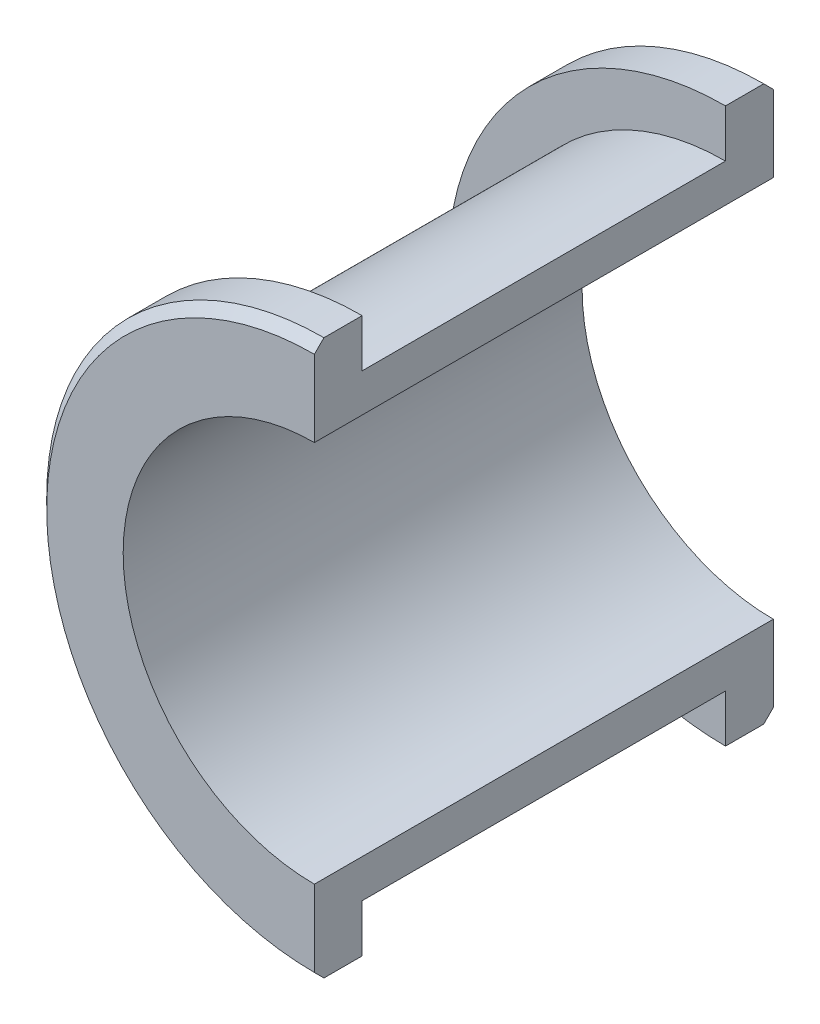
ISO-10303-21;
HEADER;
FILE_DESCRIPTION(('STEP AP214'),'2;1');
FILE_NAME('part.step','',(''),(''),'','','');
FILE_SCHEMA(('AUTOMOTIVE_DESIGN { 1 0 10303 214 1 1 1 1 }'));
ENDSEC;
DATA;
#1=APPLICATION_CONTEXT('core data for automotive mechanical design processes');
#2=APPLICATION_PROTOCOL_DEFINITION('international standard','automotive_design',2000,#1);
#3=PRODUCT_CONTEXT('',#1,'mechanical');
#4=PRODUCT('Part','Part','',(#3));
#5=PRODUCT_RELATED_PRODUCT_CATEGORY('part','',(#4));
#6=PRODUCT_DEFINITION_FORMATION('','',#4);
#7=PRODUCT_DEFINITION_CONTEXT('part definition',#1,'design');
#8=PRODUCT_DEFINITION('design','',#6,#7);
#9=PRODUCT_DEFINITION_SHAPE('','',#8);
#10=(LENGTH_UNIT() NAMED_UNIT(*) SI_UNIT(.MILLI.,.METRE.));
#11=(NAMED_UNIT(*) PLANE_ANGLE_UNIT() SI_UNIT($,.RADIAN.));
#12=(NAMED_UNIT(*) SI_UNIT($,.STERADIAN.) SOLID_ANGLE_UNIT());
#13=UNCERTAINTY_MEASURE_WITH_UNIT(LENGTH_MEASURE(1.E-05),#10,'distance_accuracy_value','');
#14=(GEOMETRIC_REPRESENTATION_CONTEXT(3) GLOBAL_UNCERTAINTY_ASSIGNED_CONTEXT((#13)) GLOBAL_UNIT_ASSIGNED_CONTEXT((#10,
#11,#12)) REPRESENTATION_CONTEXT('',''));
#15=CARTESIAN_POINT('',(0.,0.,0.));
#16=DIRECTION('',(0.,0.,1.));
#17=DIRECTION('',(1.,0.,0.));
#18=AXIS2_PLACEMENT_3D('',#15,#16,#17);
#19=CARTESIAN_POINT('',(0.,0.,19.));
#20=DIRECTION('',(0.,0.,1.));
#21=DIRECTION('',(1.,0.,0.));
#22=AXIS2_PLACEMENT_3D('',#19,#20,#21);
#23=CYLINDRICAL_SURFACE('',#22,29.);
#24=DIRECTION('',(0.,0.,1.));
#25=VECTOR('',#24,1.);
#26=CARTESIAN_POINT('',(0.,-29.,-24.));
#27=LINE('',#26,#25);
#28=CARTESIAN_POINT('',(0.,-29.,19.));
#29=VERTEX_POINT('',#28);
#30=CARTESIAN_POINT('',(0.,-29.,23.));
#31=VERTEX_POINT('',#30);
#32=EDGE_CURVE('E126',#29,#31,#27,.T.);
#33=ORIENTED_EDGE('',*,*,#32,.T.);
#34=CARTESIAN_POINT('',(0.,0.,23.));
#35=DIRECTION('',(0.,0.,1.));
#36=DIRECTION('',(1.,0.,0.));
#37=AXIS2_PLACEMENT_3D('',#34,#35,#36);
#38=CIRCLE('',#37,29.);
#39=CARTESIAN_POINT('',(0.,29.,23.));
#40=VERTEX_POINT('',#39);
#41=EDGE_CURVE('E11',#31,#40,#38,.F.);
#42=ORIENTED_EDGE('',*,*,#41,.T.);
#43=DIRECTION('',(0.,0.,1.));
#44=VECTOR('',#43,1.);
#45=CARTESIAN_POINT('',(0.,29.,-24.));
#46=LINE('',#45,#44);
#47=CARTESIAN_POINT('',(0.,29.,19.));
#48=VERTEX_POINT('',#47);
#49=EDGE_CURVE('E125',#48,#40,#46,.T.);
#50=ORIENTED_EDGE('',*,*,#49,.F.);
#51=CARTESIAN_POINT('',(0.,0.,19.));
#52=DIRECTION('',(0.,0.,1.));
#53=DIRECTION('',(1.,0.,0.));
#54=AXIS2_PLACEMENT_3D('',#51,#52,#53);
#55=CIRCLE('',#54,29.);
#56=EDGE_CURVE('E152',#48,#29,#55,.T.);
#57=ORIENTED_EDGE('',*,*,#56,.T.);
#58=EDGE_LOOP('',(#33,#42,#50,#57));
#59=FACE_BOUND('',#58,.T.);
#60=ADVANCED_FACE('F38',(#59),#23,.T.);
#61=CARTESIAN_POINT('',(0.,0.,24.));
#62=DIRECTION('',(0.,0.,-1.));
#63=DIRECTION('',(-1.,0.,0.));
#64=AXIS2_PLACEMENT_3D('',#61,#62,#63);
#65=CYLINDRICAL_SURFACE('',#64,24.);
#66=CARTESIAN_POINT('',(0.,0.,19.));
#67=DIRECTION('',(0.,0.,1.));
#68=DIRECTION('',(1.,0.,0.));
#69=AXIS2_PLACEMENT_3D('',#66,#67,#68);
#70=CIRCLE('',#69,24.);
#71=CARTESIAN_POINT('',(0.,24.,19.));
#72=VERTEX_POINT('',#71);
#73=CARTESIAN_POINT('',(0.,-24.,19.));
#74=VERTEX_POINT('',#73);
#75=EDGE_CURVE('E158',#72,#74,#70,.T.);
#76=ORIENTED_EDGE('',*,*,#75,.F.);
#77=DIRECTION('',(0.,0.,-1.));
#78=VECTOR('',#77,1.);
#79=CARTESIAN_POINT('',(0.,24.,24.));
#80=LINE('',#79,#78);
#81=CARTESIAN_POINT('',(0.,24.,-19.));
#82=VERTEX_POINT('',#81);
#83=EDGE_CURVE('E187',#72,#82,#80,.T.);
#84=ORIENTED_EDGE('',*,*,#83,.T.);
#85=CARTESIAN_POINT('',(0.,0.,-19.));
#86=DIRECTION('',(0.,0.,1.));
#87=DIRECTION('',(1.,0.,0.));
#88=AXIS2_PLACEMENT_3D('',#85,#86,#87);
#89=CIRCLE('',#88,24.);
#90=CARTESIAN_POINT('',(0.,-24.,-19.));
#91=VERTEX_POINT('',#90);
#92=EDGE_CURVE('E144',#82,#91,#89,.T.);
#93=ORIENTED_EDGE('',*,*,#92,.T.);
#94=DIRECTION('',(0.,0.,-1.));
#95=VECTOR('',#94,1.);
#96=CARTESIAN_POINT('',(0.,-24.,24.));
#97=LINE('',#96,#95);
#98=EDGE_CURVE('E132',#91,#74,#97,.F.);
#99=ORIENTED_EDGE('',*,*,#98,.T.);
#100=EDGE_LOOP('',(#76,#84,#93,#99));
#101=FACE_BOUND('',#100,.T.);
#102=ADVANCED_FACE('F209',(#101),#65,.T.);
#103=CARTESIAN_POINT('',(0.,0.,24.));
#104=DIRECTION('',(0.,0.,1.));
#105=DIRECTION('',(1.,0.,0.));
#106=AXIS2_PLACEMENT_3D('',#103,#104,#105);
#107=PLANE('',#106);
#108=DIRECTION('',(0.,-1.,0.));
#109=VECTOR('',#108,1.);
#110=CARTESIAN_POINT('',(0.,-29.,24.));
#111=LINE('',#110,#109);
#112=CARTESIAN_POINT('',(0.,28.,24.));
#113=VERTEX_POINT('',#112);
#114=CARTESIAN_POINT('',(0.,20.,24.));
#115=VERTEX_POINT('',#114);
#116=EDGE_CURVE('E178',#113,#115,#111,.T.);
#117=ORIENTED_EDGE('',*,*,#116,.F.);
#118=CARTESIAN_POINT('',(0.,0.,24.));
#119=DIRECTION('',(0.,0.,1.));
#120=DIRECTION('',(1.,0.,0.));
#121=AXIS2_PLACEMENT_3D('',#118,#119,#120);
#122=CIRCLE('',#121,28.);
#123=CARTESIAN_POINT('',(0.,-28.,24.));
#124=VERTEX_POINT('',#123);
#125=EDGE_CURVE('E46',#113,#124,#122,.T.);
#126=ORIENTED_EDGE('',*,*,#125,.T.);
#127=CARTESIAN_POINT('',(0.,-20.,24.));
#128=VERTEX_POINT('',#127);
#129=EDGE_CURVE('E177',#128,#124,#111,.T.);
#130=ORIENTED_EDGE('',*,*,#129,.F.);
#131=CARTESIAN_POINT('',(0.,0.,24.));
#132=DIRECTION('',(0.,0.,1.));
#133=DIRECTION('',(1.,0.,0.));
#134=AXIS2_PLACEMENT_3D('',#131,#132,#133);
#135=CIRCLE('',#134,20.);
#136=EDGE_CURVE('E155',#115,#128,#135,.T.);
#137=ORIENTED_EDGE('',*,*,#136,.F.);
#138=EDGE_LOOP('',(#117,#126,#130,#137));
#139=FACE_BOUND('',#138,.T.);
#140=ADVANCED_FACE('F175',(#139),#107,.T.);
#141=CARTESIAN_POINT('',(0.,0.,24.));
#142=DIRECTION('',(0.,0.,-1.));
#143=DIRECTION('',(-1.,0.,0.));
#144=AXIS2_PLACEMENT_3D('',#141,#142,#143);
#145=CYLINDRICAL_SURFACE('',#144,20.);
#146=DIRECTION('',(0.,0.,-1.));
#147=VECTOR('',#146,1.);
#148=CARTESIAN_POINT('',(0.,20.,24.));
#149=LINE('',#148,#147);
#150=CARTESIAN_POINT('',(0.,20.,-24.));
#151=VERTEX_POINT('',#150);
#152=EDGE_CURVE('E141',#115,#151,#149,.T.);
#153=ORIENTED_EDGE('',*,*,#152,.F.);
#154=ORIENTED_EDGE('',*,*,#136,.T.);
#155=DIRECTION('',(0.,0.,-1.));
#156=VECTOR('',#155,1.);
#157=CARTESIAN_POINT('',(0.,-20.,24.));
#158=LINE('',#157,#156);
#159=CARTESIAN_POINT('',(0.,-20.,-24.));
#160=VERTEX_POINT('',#159);
#161=EDGE_CURVE('E147',#160,#128,#158,.F.);
#162=ORIENTED_EDGE('',*,*,#161,.F.);
#163=CARTESIAN_POINT('',(0.,0.,-24.));
#164=DIRECTION('',(0.,0.,1.));
#165=DIRECTION('',(1.,0.,0.));
#166=AXIS2_PLACEMENT_3D('',#163,#164,#165);
#167=CIRCLE('',#166,20.);
#168=EDGE_CURVE('E140',#151,#160,#167,.T.);
#169=ORIENTED_EDGE('',*,*,#168,.F.);
#170=EDGE_LOOP('',(#153,#154,#162,#169));
#171=FACE_BOUND('',#170,.T.);
#172=ADVANCED_FACE('F219',(#171),#145,.F.);
#173=CARTESIAN_POINT('',(0.,0.,19.));
#174=DIRECTION('',(0.,0.,1.));
#175=DIRECTION('',(1.,0.,0.));
#176=AXIS2_PLACEMENT_3D('',#173,#174,#175);
#177=PLANE('',#176);
#178=ORIENTED_EDGE('',*,*,#56,.F.);
#179=DIRECTION('',(0.,-1.,0.));
#180=VECTOR('',#179,1.);
#181=CARTESIAN_POINT('',(0.,0.,19.));
#182=LINE('',#181,#180);
#183=EDGE_CURVE('E191',#48,#72,#182,.T.);
#184=ORIENTED_EDGE('',*,*,#183,.T.);
#185=ORIENTED_EDGE('',*,*,#75,.T.);
#186=EDGE_CURVE('E194',#74,#29,#182,.T.);
#187=ORIENTED_EDGE('',*,*,#186,.T.);
#188=EDGE_LOOP('',(#178,#184,#185,#187));
#189=FACE_BOUND('',#188,.T.);
#190=ADVANCED_FACE('F198',(#189),#177,.F.);
#191=CARTESIAN_POINT('',(0.,0.,-24.));
#192=DIRECTION('',(0.,0.,-1.));
#193=DIRECTION('',(1.,0.,0.));
#194=AXIS2_PLACEMENT_3D('',#191,#192,#193);
#195=PLANE('',#194);
#196=DIRECTION('',(0.,-1.,0.));
#197=VECTOR('',#196,1.);
#198=CARTESIAN_POINT('',(0.,-29.,-24.));
#199=LINE('',#198,#197);
#200=CARTESIAN_POINT('',(0.,-28.,-24.));
#201=VERTEX_POINT('',#200);
#202=EDGE_CURVE('E182',#160,#201,#199,.T.);
#203=ORIENTED_EDGE('',*,*,#202,.T.);
#204=CARTESIAN_POINT('',(0.,0.,-24.));
#205=DIRECTION('',(0.,0.,-1.));
#206=DIRECTION('',(-1.,0.,0.));
#207=AXIS2_PLACEMENT_3D('',#204,#205,#206);
#208=CIRCLE('',#207,28.);
#209=CARTESIAN_POINT('',(0.,28.,-24.));
#210=VERTEX_POINT('',#209);
#211=EDGE_CURVE('E166',#201,#210,#208,.T.);
#212=ORIENTED_EDGE('',*,*,#211,.T.);
#213=EDGE_CURVE('E185',#210,#151,#199,.T.);
#214=ORIENTED_EDGE('',*,*,#213,.T.);
#215=ORIENTED_EDGE('',*,*,#168,.T.);
#216=EDGE_LOOP('',(#203,#212,#214,#215));
#217=FACE_BOUND('',#216,.T.);
#218=ADVANCED_FACE('F241',(#217),#195,.T.);
#219=CARTESIAN_POINT('',(0.,0.,-19.));
#220=DIRECTION('',(0.,0.,-1.));
#221=DIRECTION('',(1.,0.,0.));
#222=AXIS2_PLACEMENT_3D('',#219,#220,#221);
#223=CYLINDRICAL_SURFACE('',#222,29.);
#224=CARTESIAN_POINT('',(0.,29.,-23.));
#225=VERTEX_POINT('',#224);
#226=CARTESIAN_POINT('',(0.,29.,-19.));
#227=VERTEX_POINT('',#226);
#228=EDGE_CURVE('E186',#225,#227,#46,.T.);
#229=ORIENTED_EDGE('',*,*,#228,.F.);
#230=CARTESIAN_POINT('',(0.,0.,-23.));
#231=DIRECTION('',(0.,0.,-1.));
#232=DIRECTION('',(-1.,0.,0.));
#233=AXIS2_PLACEMENT_3D('',#230,#231,#232);
#234=CIRCLE('',#233,29.);
#235=CARTESIAN_POINT('',(0.,-29.,-23.));
#236=VERTEX_POINT('',#235);
#237=EDGE_CURVE('E123',#225,#236,#234,.F.);
#238=ORIENTED_EDGE('',*,*,#237,.T.);
#239=CARTESIAN_POINT('',(0.,-29.,-19.));
#240=VERTEX_POINT('',#239);
#241=EDGE_CURVE('E116',#236,#240,#27,.T.);
#242=ORIENTED_EDGE('',*,*,#241,.T.);
#243=CARTESIAN_POINT('',(0.,0.,-19.));
#244=DIRECTION('',(0.,0.,1.));
#245=DIRECTION('',(1.,0.,0.));
#246=AXIS2_PLACEMENT_3D('',#243,#244,#245);
#247=CIRCLE('',#246,29.);
#248=EDGE_CURVE('E121',#227,#240,#247,.T.);
#249=ORIENTED_EDGE('',*,*,#248,.F.);
#250=EDGE_LOOP('',(#229,#238,#242,#249));
#251=FACE_BOUND('',#250,.T.);
#252=ADVANCED_FACE('F119',(#251),#223,.T.);
#253=CARTESIAN_POINT('',(0.,0.,-19.));
#254=DIRECTION('',(0.,0.,-1.));
#255=DIRECTION('',(1.,0.,0.));
#256=AXIS2_PLACEMENT_3D('',#253,#254,#255);
#257=PLANE('',#256);
#258=ORIENTED_EDGE('',*,*,#248,.T.);
#259=DIRECTION('',(0.,1.,0.));
#260=VECTOR('',#259,1.);
#261=CARTESIAN_POINT('',(0.,0.,-19.));
#262=LINE('',#261,#260);
#263=EDGE_CURVE('E129',#240,#91,#262,.T.);
#264=ORIENTED_EDGE('',*,*,#263,.T.);
#265=ORIENTED_EDGE('',*,*,#92,.F.);
#266=EDGE_CURVE('E136',#82,#227,#262,.T.);
#267=ORIENTED_EDGE('',*,*,#266,.T.);
#268=EDGE_LOOP('',(#258,#264,#265,#267));
#269=FACE_BOUND('',#268,.T.);
#270=ADVANCED_FACE('F139',(#269),#257,.F.);
#271=CARTESIAN_POINT('',(0.,-29.,-24.));
#272=DIRECTION('',(-1.,0.,0.));
#273=DIRECTION('',(0.,0.,1.));
#274=AXIS2_PLACEMENT_3D('',#271,#272,#273);
#275=PLANE('',#274);
#276=ORIENTED_EDGE('',*,*,#213,.F.);
#277=DIRECTION('',(0.,-0.707106781186547,-0.707106781186548));
#278=VECTOR('',#277,1.);
#279=CARTESIAN_POINT('',(0.,0.,-52.));
#280=LINE('',#279,#278);
#281=EDGE_CURVE('E169',#210,#225,#280,.F.);
#282=ORIENTED_EDGE('',*,*,#281,.T.);
#283=ORIENTED_EDGE('',*,*,#228,.T.);
#284=ORIENTED_EDGE('',*,*,#266,.F.);
#285=ORIENTED_EDGE('',*,*,#83,.F.);
#286=ORIENTED_EDGE('',*,*,#183,.F.);
#287=ORIENTED_EDGE('',*,*,#49,.T.);
#288=DIRECTION('',(0.,0.707106781186544,-0.707106781186551));
#289=VECTOR('',#288,1.);
#290=CARTESIAN_POINT('',(0.,0.,52.0000000000003));
#291=LINE('',#290,#289);
#292=EDGE_CURVE('E53',#40,#113,#291,.F.);
#293=ORIENTED_EDGE('',*,*,#292,.T.);
#294=ORIENTED_EDGE('',*,*,#116,.T.);
#295=ORIENTED_EDGE('',*,*,#152,.T.);
#296=EDGE_LOOP('',(#276,#282,#283,#284,#285,#286,#287,#293,#294,#295));
#297=FACE_BOUND('',#296,.T.);
#298=ADVANCED_FACE('F201',(#297),#275,.F.);
#299=ORIENTED_EDGE('',*,*,#241,.F.);
#300=DIRECTION('',(0.,-0.707106781186547,0.707106781186548));
#301=VECTOR('',#300,1.);
#302=CARTESIAN_POINT('',(0.,0.,-52.));
#303=LINE('',#302,#301);
#304=EDGE_CURVE('E164',#236,#201,#303,.F.);
#305=ORIENTED_EDGE('',*,*,#304,.T.);
#306=ORIENTED_EDGE('',*,*,#202,.F.);
#307=ORIENTED_EDGE('',*,*,#161,.T.);
#308=ORIENTED_EDGE('',*,*,#129,.T.);
#309=DIRECTION('',(0.,0.707106781186544,0.707106781186551));
#310=VECTOR('',#309,1.);
#311=CARTESIAN_POINT('',(0.,0.,52.0000000000003));
#312=LINE('',#311,#310);
#313=EDGE_CURVE('E162',#124,#31,#312,.F.);
#314=ORIENTED_EDGE('',*,*,#313,.T.);
#315=ORIENTED_EDGE('',*,*,#32,.F.);
#316=ORIENTED_EDGE('',*,*,#186,.F.);
#317=ORIENTED_EDGE('',*,*,#98,.F.);
#318=ORIENTED_EDGE('',*,*,#263,.F.);
#319=EDGE_LOOP('',(#299,#305,#306,#307,#308,#314,#315,#316,#317,#318));
#320=FACE_BOUND('',#319,.T.);
#321=ADVANCED_FACE('F130',(#320),#275,.F.);
#322=CARTESIAN_POINT('',(0.,0.,-23.));
#323=DIRECTION('',(0.,0.,1.));
#324=DIRECTION('',(1.,0.,0.));
#325=AXIS2_PLACEMENT_3D('',#322,#323,#324);
#326=CONICAL_SURFACE('',#325,29.,0.785398163397448);
#327=ORIENTED_EDGE('',*,*,#281,.F.);
#328=ORIENTED_EDGE('',*,*,#211,.F.);
#329=ORIENTED_EDGE('',*,*,#304,.F.);
#330=ORIENTED_EDGE('',*,*,#237,.F.);
#331=EDGE_LOOP('',(#327,#328,#329,#330));
#332=FACE_BOUND('',#331,.T.);
#333=ADVANCED_FACE('F203',(#332),#326,.T.);
#334=CARTESIAN_POINT('',(0.,0.,24.));
#335=DIRECTION('',(0.,0.,-1.));
#336=DIRECTION('',(-1.,0.,0.));
#337=AXIS2_PLACEMENT_3D('',#334,#335,#336);
#338=CONICAL_SURFACE('',#337,28.,0.785398163397443);
#339=ORIENTED_EDGE('',*,*,#292,.F.);
#340=ORIENTED_EDGE('',*,*,#41,.F.);
#341=ORIENTED_EDGE('',*,*,#313,.F.);
#342=ORIENTED_EDGE('',*,*,#125,.F.);
#343=EDGE_LOOP('',(#339,#340,#341,#342));
#344=FACE_BOUND('',#343,.T.);
#345=ADVANCED_FACE('F40',(#344),#338,.T.);
#346=CLOSED_SHELL('',(#60,#102,#140,#172,#190,#218,#252,#270,#298,#321,#333,#345));
#347=MANIFOLD_SOLID_BREP('B2',#346);
#348=ADVANCED_BREP_SHAPE_REPRESENTATION('',(#18,#347),#14);
#349=SHAPE_DEFINITION_REPRESENTATION(#9,#348);
ENDSEC;
END-ISO-10303-21;
